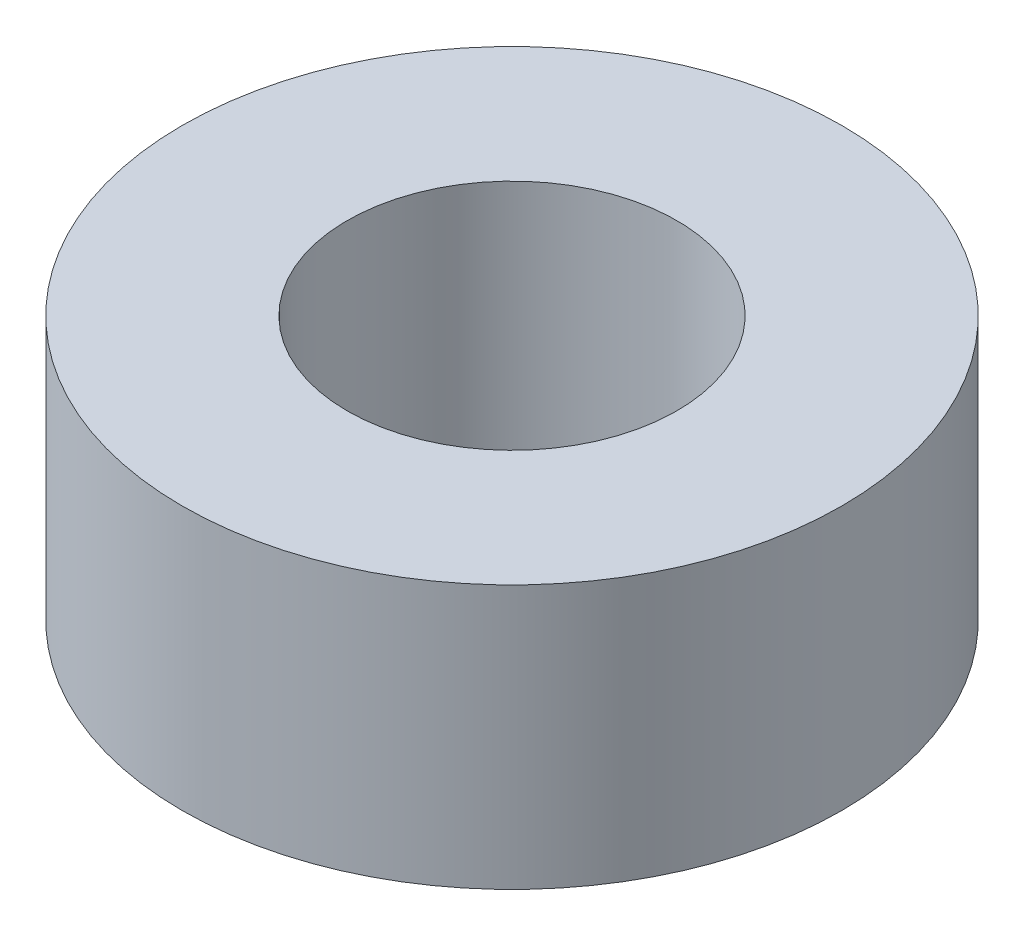
ISO-10303-21;
HEADER;
FILE_DESCRIPTION(('STEP AP214'),'2;1');
FILE_NAME('part.step','',(''),(''),'','','');
FILE_SCHEMA(('AUTOMOTIVE_DESIGN { 1 0 10303 214 1 1 1 1 }'));
ENDSEC;
DATA;
#1=APPLICATION_CONTEXT('core data for automotive mechanical design processes');
#2=APPLICATION_PROTOCOL_DEFINITION('international standard','automotive_design',2000,#1);
#3=PRODUCT_CONTEXT('',#1,'mechanical');
#4=PRODUCT('Part','Part','',(#3));
#5=PRODUCT_RELATED_PRODUCT_CATEGORY('part','',(#4));
#6=PRODUCT_DEFINITION_FORMATION('','',#4);
#7=PRODUCT_DEFINITION_CONTEXT('part definition',#1,'design');
#8=PRODUCT_DEFINITION('design','',#6,#7);
#9=PRODUCT_DEFINITION_SHAPE('','',#8);
#10=(LENGTH_UNIT() NAMED_UNIT(*) SI_UNIT(.MILLI.,.METRE.));
#11=(NAMED_UNIT(*) PLANE_ANGLE_UNIT() SI_UNIT($,.RADIAN.));
#12=(NAMED_UNIT(*) SI_UNIT($,.STERADIAN.) SOLID_ANGLE_UNIT());
#13=UNCERTAINTY_MEASURE_WITH_UNIT(LENGTH_MEASURE(1.E-05),#10,'distance_accuracy_value','');
#14=(GEOMETRIC_REPRESENTATION_CONTEXT(3) GLOBAL_UNCERTAINTY_ASSIGNED_CONTEXT((#13)) GLOBAL_UNIT_ASSIGNED_CONTEXT((#10,
#11,#12)) REPRESENTATION_CONTEXT('',''));
#15=CARTESIAN_POINT('',(0.,0.,0.));
#16=DIRECTION('',(0.,0.,1.));
#17=DIRECTION('',(1.,0.,0.));
#18=AXIS2_PLACEMENT_3D('',#15,#16,#17);
#19=CARTESIAN_POINT('',(0.,12.,0.));
#20=DIRECTION('',(0.,-1.,0.));
#21=DIRECTION('',(0.,0.,-1.));
#22=AXIS2_PLACEMENT_3D('',#19,#20,#21);
#23=CYLINDRICAL_SURFACE('',#22,15.);
#24=CARTESIAN_POINT('',(0.,12.,0.));
#25=DIRECTION('',(0.,1.,0.));
#26=DIRECTION('',(0.,0.,1.));
#27=AXIS2_PLACEMENT_3D('',#24,#25,#26);
#28=CIRCLE('',#27,15.);
#29=CARTESIAN_POINT('',(0.,12.,15.));
#30=VERTEX_POINT('',#29);
#31=EDGE_CURVE('E10',#30,#30,#28,.T.);
#32=ORIENTED_EDGE('',*,*,#31,.F.);
#33=EDGE_LOOP('',(#32));
#34=FACE_BOUND('',#33,.T.);
#35=CARTESIAN_POINT('',(0.,0.,0.));
#36=DIRECTION('',(0.,1.,0.));
#37=DIRECTION('',(0.,0.,1.));
#38=AXIS2_PLACEMENT_3D('',#35,#36,#37);
#39=CIRCLE('',#38,15.);
#40=CARTESIAN_POINT('',(0.,0.,15.));
#41=VERTEX_POINT('',#40);
#42=EDGE_CURVE('E37',#41,#41,#39,.T.);
#43=ORIENTED_EDGE('',*,*,#42,.T.);
#44=EDGE_LOOP('',(#43));
#45=FACE_BOUND('',#44,.T.);
#46=ADVANCED_FACE('F40',(#34,#45),#23,.T.);
#47=CARTESIAN_POINT('',(0.,12.,0.));
#48=DIRECTION('',(0.,1.,0.));
#49=DIRECTION('',(0.,0.,1.));
#50=AXIS2_PLACEMENT_3D('',#47,#48,#49);
#51=PLANE('',#50);
#52=CARTESIAN_POINT('',(0.,12.,0.));
#53=DIRECTION('',(0.,1.,0.));
#54=DIRECTION('',(0.,0.,1.));
#55=AXIS2_PLACEMENT_3D('',#52,#53,#54);
#56=CIRCLE('',#55,7.5);
#57=CARTESIAN_POINT('',(0.,12.,7.5));
#58=VERTEX_POINT('',#57);
#59=EDGE_CURVE('E50',#58,#58,#56,.T.);
#60=ORIENTED_EDGE('',*,*,#59,.F.);
#61=EDGE_LOOP('',(#60));
#62=FACE_BOUND('',#61,.T.);
#63=ORIENTED_EDGE('',*,*,#31,.T.);
#64=EDGE_LOOP('',(#63));
#65=FACE_BOUND('',#64,.T.);
#66=ADVANCED_FACE('F59',(#62,#65),#51,.T.);
#67=CARTESIAN_POINT('',(0.,0.,0.));
#68=DIRECTION('',(0.,1.,0.));
#69=DIRECTION('',(0.,0.,1.));
#70=AXIS2_PLACEMENT_3D('',#67,#68,#69);
#71=PLANE('',#70);
#72=CARTESIAN_POINT('',(0.,0.,0.));
#73=DIRECTION('',(0.,1.,0.));
#74=DIRECTION('',(0.,0.,1.));
#75=AXIS2_PLACEMENT_3D('',#72,#73,#74);
#76=CIRCLE('',#75,7.5);
#77=CARTESIAN_POINT('',(0.,0.,7.5));
#78=VERTEX_POINT('',#77);
#79=EDGE_CURVE('E47',#78,#78,#76,.T.);
#80=ORIENTED_EDGE('',*,*,#79,.T.);
#81=EDGE_LOOP('',(#80));
#82=FACE_BOUND('',#81,.T.);
#83=ORIENTED_EDGE('',*,*,#42,.F.);
#84=EDGE_LOOP('',(#83));
#85=FACE_BOUND('',#84,.T.);
#86=ADVANCED_FACE('F58',(#82,#85),#71,.F.);
#87=CARTESIAN_POINT('',(0.,12.,0.));
#88=DIRECTION('',(0.,-1.,0.));
#89=DIRECTION('',(0.,0.,-1.));
#90=AXIS2_PLACEMENT_3D('',#87,#88,#89);
#91=CYLINDRICAL_SURFACE('',#90,7.5);
#92=ORIENTED_EDGE('',*,*,#59,.T.);
#93=EDGE_LOOP('',(#92));
#94=FACE_BOUND('',#93,.T.);
#95=ORIENTED_EDGE('',*,*,#79,.F.);
#96=EDGE_LOOP('',(#95));
#97=FACE_BOUND('',#96,.T.);
#98=ADVANCED_FACE('F54',(#94,#97),#91,.F.);
#99=CLOSED_SHELL('',(#46,#66,#86,#98));
#100=MANIFOLD_SOLID_BREP('B2',#99);
#101=ADVANCED_BREP_SHAPE_REPRESENTATION('',(#18,#100),#14);
#102=SHAPE_DEFINITION_REPRESENTATION(#9,#101);
ENDSEC;
END-ISO-10303-21;
